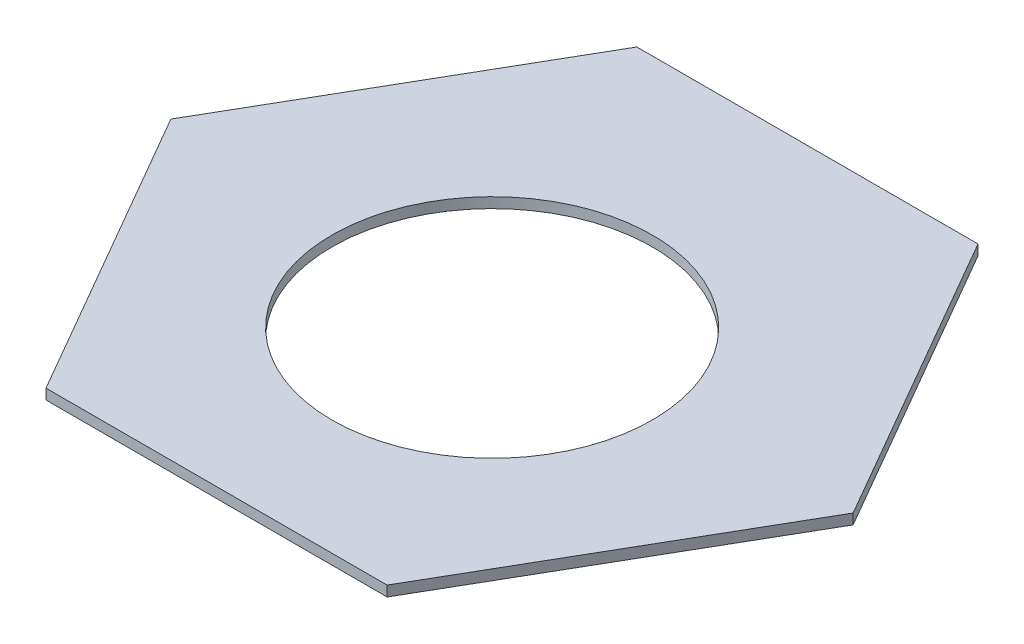
ISO-10303-21;
HEADER;
FILE_DESCRIPTION(('STEP AP214'),'2;1');
FILE_NAME('part.step','',(''),(''),'','','');
FILE_SCHEMA(('AUTOMOTIVE_DESIGN { 1 0 10303 214 1 1 1 1 }'));
ENDSEC;
DATA;
#1=APPLICATION_CONTEXT('core data for automotive mechanical design processes');
#2=APPLICATION_PROTOCOL_DEFINITION('international standard','automotive_design',2000,#1);
#3=PRODUCT_CONTEXT('',#1,'mechanical');
#4=PRODUCT('Part','Part','',(#3));
#5=PRODUCT_RELATED_PRODUCT_CATEGORY('part','',(#4));
#6=PRODUCT_DEFINITION_FORMATION('','',#4);
#7=PRODUCT_DEFINITION_CONTEXT('part definition',#1,'design');
#8=PRODUCT_DEFINITION('design','',#6,#7);
#9=PRODUCT_DEFINITION_SHAPE('','',#8);
#10=(LENGTH_UNIT() NAMED_UNIT(*) SI_UNIT(.MILLI.,.METRE.));
#11=(NAMED_UNIT(*) PLANE_ANGLE_UNIT() SI_UNIT($,.RADIAN.));
#12=(NAMED_UNIT(*) SI_UNIT($,.STERADIAN.) SOLID_ANGLE_UNIT());
#13=UNCERTAINTY_MEASURE_WITH_UNIT(LENGTH_MEASURE(1.E-05),#10,'distance_accuracy_value','');
#14=(GEOMETRIC_REPRESENTATION_CONTEXT(3) GLOBAL_UNCERTAINTY_ASSIGNED_CONTEXT((#13)) GLOBAL_UNIT_ASSIGNED_CONTEXT((#10,
#11,#12)) REPRESENTATION_CONTEXT('',''));
#15=CARTESIAN_POINT('',(0.,0.,0.));
#16=DIRECTION('',(0.,0.,1.));
#17=DIRECTION('',(1.,0.,0.));
#18=AXIS2_PLACEMENT_3D('',#15,#16,#17);
#19=CARTESIAN_POINT('',(0.,5.,0.));
#20=DIRECTION('',(0.,1.,0.));
#21=DIRECTION('',(0.,0.,1.));
#22=AXIS2_PLACEMENT_3D('',#19,#20,#21);
#23=PLANE('',#22);
#24=DIRECTION('',(0.499999999999995,0.,-0.866025403784442));
#25=VECTOR('',#24,1.);
#26=CARTESIAN_POINT('',(82.5000000000015,5.,142.894191624431));
#27=LINE('',#26,#25);
#28=CARTESIAN_POINT('',(82.5000000000015,5.,142.894191624431));
#29=VERTEX_POINT('',#28);
#30=CARTESIAN_POINT('',(165.,5.,0.));
#31=VERTEX_POINT('',#30);
#32=EDGE_CURVE('E129',#29,#31,#27,.T.);
#33=ORIENTED_EDGE('',*,*,#32,.T.);
#34=DIRECTION('',(-0.500000000000001,0.,-0.866025403784438));
#35=VECTOR('',#34,1.);
#36=CARTESIAN_POINT('',(165.,5.,0.));
#37=LINE('',#36,#35);
#38=CARTESIAN_POINT('',(82.4999999999995,5.,-142.894191624432));
#39=VERTEX_POINT('',#38);
#40=EDGE_CURVE('E87',#31,#39,#37,.T.);
#41=ORIENTED_EDGE('',*,*,#40,.T.);
#42=DIRECTION('',(-1.,0.,0.));
#43=VECTOR('',#42,1.);
#44=CARTESIAN_POINT('',(82.4999999999995,5.,-142.894191624432));
#45=LINE('',#44,#43);
#46=CARTESIAN_POINT('',(-82.5000000000005,5.,-142.894191624432));
#47=VERTEX_POINT('',#46);
#48=EDGE_CURVE('E100',#39,#47,#45,.T.);
#49=ORIENTED_EDGE('',*,*,#48,.T.);
#50=DIRECTION('',(-0.499999999999995,0.,0.866025403784442));
#51=VECTOR('',#50,1.);
#52=CARTESIAN_POINT('',(-82.5000000000005,5.,-142.894191624432));
#53=LINE('',#52,#51);
#54=CARTESIAN_POINT('',(-165.,5.,1.15218884181823E-12));
#55=VERTEX_POINT('',#54);
#56=EDGE_CURVE('E94',#47,#55,#53,.T.);
#57=ORIENTED_EDGE('',*,*,#56,.T.);
#58=DIRECTION('',(0.500000000000007,0.,0.866025403784435));
#59=VECTOR('',#58,1.);
#60=CARTESIAN_POINT('',(-165.,5.,1.15218884181823E-12));
#61=LINE('',#60,#59);
#62=CARTESIAN_POINT('',(-82.4999999999985,5.,142.894191624433));
#63=VERTEX_POINT('',#62);
#64=EDGE_CURVE('E98',#55,#63,#61,.T.);
#65=ORIENTED_EDGE('',*,*,#64,.T.);
#66=DIRECTION('',(1.,0.,0.));
#67=VECTOR('',#66,1.);
#68=CARTESIAN_POINT('',(-82.4999999999985,5.,142.894191624433));
#69=LINE('',#68,#67);
#70=EDGE_CURVE('E50',#63,#29,#69,.T.);
#71=ORIENTED_EDGE('',*,*,#70,.T.);
#72=EDGE_LOOP('',(#33,#41,#49,#57,#65,#71));
#73=FACE_BOUND('',#72,.T.);
#74=CARTESIAN_POINT('',(0.,5.,9.60580837556768));
#75=DIRECTION('',(0.,1.,0.));
#76=DIRECTION('',(0.,0.,1.));
#77=AXIS2_PLACEMENT_3D('',#74,#75,#76);
#78=CIRCLE('',#77,77.5);
#79=CARTESIAN_POINT('',(0.,5.,87.1058083755677));
#80=VERTEX_POINT('',#79);
#81=EDGE_CURVE('E122',#80,#80,#78,.T.);
#82=ORIENTED_EDGE('',*,*,#81,.F.);
#83=EDGE_LOOP('',(#82));
#84=FACE_BOUND('',#83,.T.);
#85=ADVANCED_FACE('F33',(#73,#84),#23,.T.);
#86=CARTESIAN_POINT('',(0.,0.,0.));
#87=DIRECTION('',(0.,1.,0.));
#88=DIRECTION('',(0.,0.,1.));
#89=AXIS2_PLACEMENT_3D('',#86,#87,#88);
#90=PLANE('',#89);
#91=DIRECTION('',(0.499999999999995,0.,-0.866025403784442));
#92=VECTOR('',#91,1.);
#93=CARTESIAN_POINT('',(82.5000000000015,0.,142.894191624431));
#94=LINE('',#93,#92);
#95=CARTESIAN_POINT('',(82.5000000000015,0.,142.894191624431));
#96=VERTEX_POINT('',#95);
#97=CARTESIAN_POINT('',(165.,0.,0.));
#98=VERTEX_POINT('',#97);
#99=EDGE_CURVE('E118',#96,#98,#94,.T.);
#100=ORIENTED_EDGE('',*,*,#99,.F.);
#101=DIRECTION('',(1.,0.,0.));
#102=VECTOR('',#101,1.);
#103=CARTESIAN_POINT('',(-82.4999999999985,0.,142.894191624433));
#104=LINE('',#103,#102);
#105=CARTESIAN_POINT('',(-82.4999999999985,0.,142.894191624433));
#106=VERTEX_POINT('',#105);
#107=EDGE_CURVE('E79',#106,#96,#104,.T.);
#108=ORIENTED_EDGE('',*,*,#107,.F.);
#109=DIRECTION('',(0.500000000000007,0.,0.866025403784435));
#110=VECTOR('',#109,1.);
#111=CARTESIAN_POINT('',(-165.,0.,1.15218884181823E-12));
#112=LINE('',#111,#110);
#113=CARTESIAN_POINT('',(-165.,0.,1.15218884181823E-12));
#114=VERTEX_POINT('',#113);
#115=EDGE_CURVE('E73',#114,#106,#112,.T.);
#116=ORIENTED_EDGE('',*,*,#115,.F.);
#117=DIRECTION('',(-0.499999999999995,0.,0.866025403784442));
#118=VECTOR('',#117,1.);
#119=CARTESIAN_POINT('',(-82.5000000000005,0.,-142.894191624432));
#120=LINE('',#119,#118);
#121=CARTESIAN_POINT('',(-82.5000000000005,0.,-142.894191624432));
#122=VERTEX_POINT('',#121);
#123=EDGE_CURVE('E108',#122,#114,#120,.T.);
#124=ORIENTED_EDGE('',*,*,#123,.F.);
#125=DIRECTION('',(-1.,0.,0.));
#126=VECTOR('',#125,1.);
#127=CARTESIAN_POINT('',(82.4999999999995,0.,-142.894191624432));
#128=LINE('',#127,#126);
#129=CARTESIAN_POINT('',(82.4999999999995,0.,-142.894191624432));
#130=VERTEX_POINT('',#129);
#131=EDGE_CURVE('E124',#130,#122,#128,.T.);
#132=ORIENTED_EDGE('',*,*,#131,.F.);
#133=DIRECTION('',(-0.500000000000001,0.,-0.866025403784438));
#134=VECTOR('',#133,1.);
#135=CARTESIAN_POINT('',(165.,0.,0.));
#136=LINE('',#135,#134);
#137=EDGE_CURVE('E121',#98,#130,#136,.T.);
#138=ORIENTED_EDGE('',*,*,#137,.F.);
#139=EDGE_LOOP('',(#100,#108,#116,#124,#132,#138));
#140=FACE_BOUND('',#139,.T.);
#141=CARTESIAN_POINT('',(0.,0.,9.60580837556768));
#142=DIRECTION('',(0.,1.,0.));
#143=DIRECTION('',(0.,0.,1.));
#144=AXIS2_PLACEMENT_3D('',#141,#142,#143);
#145=CIRCLE('',#144,77.5);
#146=CARTESIAN_POINT('',(0.,0.,87.1058083755677));
#147=VERTEX_POINT('',#146);
#148=EDGE_CURVE('E222',#147,#147,#145,.T.);
#149=ORIENTED_EDGE('',*,*,#148,.T.);
#150=EDGE_LOOP('',(#149));
#151=FACE_BOUND('',#150,.T.);
#152=ADVANCED_FACE('F138',(#140,#151),#90,.F.);
#153=CARTESIAN_POINT('',(82.5000000000015,5.,142.894191624431));
#154=DIRECTION('',(-0.866025403784442,0.,-0.499999999999995));
#155=DIRECTION('',(-0.499999999999995,0.,0.866025403784442));
#156=AXIS2_PLACEMENT_3D('',#153,#154,#155);
#157=PLANE('',#156);
#158=ORIENTED_EDGE('',*,*,#99,.T.);
#159=DIRECTION('',(0.,-1.,0.));
#160=VECTOR('',#159,1.);
#161=CARTESIAN_POINT('',(165.,5.,0.));
#162=LINE('',#161,#160);
#163=EDGE_CURVE('E11',#31,#98,#162,.T.);
#164=ORIENTED_EDGE('',*,*,#163,.F.);
#165=ORIENTED_EDGE('',*,*,#32,.F.);
#166=DIRECTION('',(0.,-1.,0.));
#167=VECTOR('',#166,1.);
#168=CARTESIAN_POINT('',(82.5000000000015,5.,142.894191624431));
#169=LINE('',#168,#167);
#170=EDGE_CURVE('E114',#29,#96,#169,.T.);
#171=ORIENTED_EDGE('',*,*,#170,.T.);
#172=EDGE_LOOP('',(#158,#164,#165,#171));
#173=FACE_BOUND('',#172,.T.);
#174=ADVANCED_FACE('F35',(#173),#157,.F.);
#175=CARTESIAN_POINT('',(165.,5.,0.));
#176=DIRECTION('',(-0.866025403784438,0.,0.500000000000001));
#177=DIRECTION('',(0.500000000000001,0.,0.866025403784438));
#178=AXIS2_PLACEMENT_3D('',#175,#176,#177);
#179=PLANE('',#178);
#180=ORIENTED_EDGE('',*,*,#137,.T.);
#181=DIRECTION('',(0.,-1.,0.));
#182=VECTOR('',#181,1.);
#183=CARTESIAN_POINT('',(82.4999999999995,5.,-142.894191624432));
#184=LINE('',#183,#182);
#185=EDGE_CURVE('E42',#39,#130,#184,.T.);
#186=ORIENTED_EDGE('',*,*,#185,.F.);
#187=ORIENTED_EDGE('',*,*,#40,.F.);
#188=ORIENTED_EDGE('',*,*,#163,.T.);
#189=EDGE_LOOP('',(#180,#186,#187,#188));
#190=FACE_BOUND('',#189,.T.);
#191=ADVANCED_FACE('F163',(#190),#179,.F.);
#192=CARTESIAN_POINT('',(82.4999999999995,5.,-142.894191624432));
#193=DIRECTION('',(0.,0.,1.));
#194=DIRECTION('',(1.,0.,0.));
#195=AXIS2_PLACEMENT_3D('',#192,#193,#194);
#196=PLANE('',#195);
#197=ORIENTED_EDGE('',*,*,#131,.T.);
#198=DIRECTION('',(0.,-1.,0.));
#199=VECTOR('',#198,1.);
#200=CARTESIAN_POINT('',(-82.5000000000005,5.,-142.894191624432));
#201=LINE('',#200,#199);
#202=EDGE_CURVE('E109',#47,#122,#201,.T.);
#203=ORIENTED_EDGE('',*,*,#202,.F.);
#204=ORIENTED_EDGE('',*,*,#48,.F.);
#205=ORIENTED_EDGE('',*,*,#185,.T.);
#206=EDGE_LOOP('',(#197,#203,#204,#205));
#207=FACE_BOUND('',#206,.T.);
#208=ADVANCED_FACE('F135',(#207),#196,.F.);
#209=CARTESIAN_POINT('',(-82.5000000000005,5.,-142.894191624432));
#210=DIRECTION('',(0.866025403784442,0.,0.499999999999995));
#211=DIRECTION('',(0.499999999999995,0.,-0.866025403784442));
#212=AXIS2_PLACEMENT_3D('',#209,#210,#211);
#213=PLANE('',#212);
#214=ORIENTED_EDGE('',*,*,#123,.T.);
#215=DIRECTION('',(0.,-1.,0.));
#216=VECTOR('',#215,1.);
#217=CARTESIAN_POINT('',(-165.,5.,1.15218884181823E-12));
#218=LINE('',#217,#216);
#219=EDGE_CURVE('E105',#55,#114,#218,.T.);
#220=ORIENTED_EDGE('',*,*,#219,.F.);
#221=ORIENTED_EDGE('',*,*,#56,.F.);
#222=ORIENTED_EDGE('',*,*,#202,.T.);
#223=EDGE_LOOP('',(#214,#220,#221,#222));
#224=FACE_BOUND('',#223,.T.);
#225=ADVANCED_FACE('F106',(#224),#213,.F.);
#226=CARTESIAN_POINT('',(-165.,5.,1.15218884181823E-12));
#227=DIRECTION('',(0.866025403784435,0.,-0.500000000000007));
#228=DIRECTION('',(-0.500000000000007,0.,-0.866025403784435));
#229=AXIS2_PLACEMENT_3D('',#226,#227,#228);
#230=PLANE('',#229);
#231=ORIENTED_EDGE('',*,*,#115,.T.);
#232=DIRECTION('',(0.,-1.,0.));
#233=VECTOR('',#232,1.);
#234=CARTESIAN_POINT('',(-82.4999999999985,5.,142.894191624433));
#235=LINE('',#234,#233);
#236=EDGE_CURVE('E110',#63,#106,#235,.T.);
#237=ORIENTED_EDGE('',*,*,#236,.F.);
#238=ORIENTED_EDGE('',*,*,#64,.F.);
#239=ORIENTED_EDGE('',*,*,#219,.T.);
#240=EDGE_LOOP('',(#231,#237,#238,#239));
#241=FACE_BOUND('',#240,.T.);
#242=ADVANCED_FACE('F112',(#241),#230,.F.);
#243=CARTESIAN_POINT('',(-82.4999999999985,5.,142.894191624433));
#244=DIRECTION('',(0.,0.,-1.));
#245=DIRECTION('',(-1.,0.,0.));
#246=AXIS2_PLACEMENT_3D('',#243,#244,#245);
#247=PLANE('',#246);
#248=ORIENTED_EDGE('',*,*,#107,.T.);
#249=ORIENTED_EDGE('',*,*,#170,.F.);
#250=ORIENTED_EDGE('',*,*,#70,.F.);
#251=ORIENTED_EDGE('',*,*,#236,.T.);
#252=EDGE_LOOP('',(#248,#249,#250,#251));
#253=FACE_BOUND('',#252,.T.);
#254=ADVANCED_FACE('F143',(#253),#247,.F.);
#255=CARTESIAN_POINT('',(0.,5.,9.60580837556768));
#256=DIRECTION('',(0.,-1.,0.));
#257=DIRECTION('',(0.,0.,-1.));
#258=AXIS2_PLACEMENT_3D('',#255,#256,#257);
#259=CYLINDRICAL_SURFACE('',#258,77.5);
#260=ORIENTED_EDGE('',*,*,#81,.T.);
#261=EDGE_LOOP('',(#260));
#262=FACE_BOUND('',#261,.T.);
#263=ORIENTED_EDGE('',*,*,#148,.F.);
#264=EDGE_LOOP('',(#263));
#265=FACE_BOUND('',#264,.T.);
#266=ADVANCED_FACE('F145',(#262,#265),#259,.F.);
#267=CLOSED_SHELL('',(#85,#152,#174,#191,#208,#225,#242,#254,#266));
#268=MANIFOLD_SOLID_BREP('B2',#267);
#269=ADVANCED_BREP_SHAPE_REPRESENTATION('',(#18,#268),#14);
#270=SHAPE_DEFINITION_REPRESENTATION(#9,#269);
ENDSEC;
END-ISO-10303-21;
